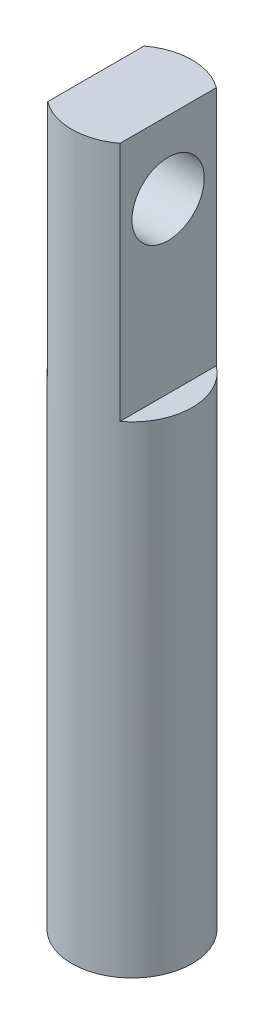
ISO-10303-21;
HEADER;
FILE_DESCRIPTION(('STEP AP214'),'2;1');
FILE_NAME('part.step','',(''),(''),'','','');
FILE_SCHEMA(('AUTOMOTIVE_DESIGN { 1 0 10303 214 1 1 1 1 }'));
ENDSEC;
DATA;
#1=APPLICATION_CONTEXT('core data for automotive mechanical design processes');
#2=APPLICATION_PROTOCOL_DEFINITION('international standard','automotive_design',2000,#1);
#3=PRODUCT_CONTEXT('',#1,'mechanical');
#4=PRODUCT('Part','Part','',(#3));
#5=PRODUCT_RELATED_PRODUCT_CATEGORY('part','',(#4));
#6=PRODUCT_DEFINITION_FORMATION('','',#4);
#7=PRODUCT_DEFINITION_CONTEXT('part definition',#1,'design');
#8=PRODUCT_DEFINITION('design','',#6,#7);
#9=PRODUCT_DEFINITION_SHAPE('','',#8);
#10=(LENGTH_UNIT() NAMED_UNIT(*) SI_UNIT(.MILLI.,.METRE.));
#11=(NAMED_UNIT(*) PLANE_ANGLE_UNIT() SI_UNIT($,.RADIAN.));
#12=(NAMED_UNIT(*) SI_UNIT($,.STERADIAN.) SOLID_ANGLE_UNIT());
#13=UNCERTAINTY_MEASURE_WITH_UNIT(LENGTH_MEASURE(1.E-05),#10,'distance_accuracy_value','');
#14=(GEOMETRIC_REPRESENTATION_CONTEXT(3) GLOBAL_UNCERTAINTY_ASSIGNED_CONTEXT((#13)) GLOBAL_UNIT_ASSIGNED_CONTEXT((#10,
#11,#12)) REPRESENTATION_CONTEXT('',''));
#15=CARTESIAN_POINT('',(0.,0.,0.));
#16=DIRECTION('',(0.,0.,1.));
#17=DIRECTION('',(1.,0.,0.));
#18=AXIS2_PLACEMENT_3D('',#15,#16,#17);
#19=CARTESIAN_POINT('',(0.,30.48,0.));
#20=DIRECTION('',(0.,-1.,0.));
#21=DIRECTION('',(0.,0.,-1.));
#22=AXIS2_PLACEMENT_3D('',#19,#20,#21);
#23=CYLINDRICAL_SURFACE('',#22,2.54);
#24=CARTESIAN_POINT('',(0.,30.48,0.));
#25=DIRECTION('',(0.,1.,0.));
#26=DIRECTION('',(0.,0.,1.));
#27=AXIS2_PLACEMENT_3D('',#24,#25,#26);
#28=CIRCLE('',#27,2.54);
#29=CARTESIAN_POINT('',(-1.524,30.48,2.032));
#30=VERTEX_POINT('',#29);
#31=CARTESIAN_POINT('',(1.524,30.48,2.032));
#32=VERTEX_POINT('',#31);
#33=EDGE_CURVE('E88',#30,#32,#28,.T.);
#34=ORIENTED_EDGE('',*,*,#33,.F.);
#35=DIRECTION('',(0.,-1.,0.));
#36=VECTOR('',#35,1.);
#37=CARTESIAN_POINT('',(-1.524,30.48,2.032));
#38=LINE('',#37,#36);
#39=CARTESIAN_POINT('',(-1.524,20.32,2.032));
#40=VERTEX_POINT('',#39);
#41=EDGE_CURVE('E46',#30,#40,#38,.T.);
#42=ORIENTED_EDGE('',*,*,#41,.T.);
#43=CARTESIAN_POINT('',(0.,20.32,0.));
#44=DIRECTION('',(0.,1.,0.));
#45=DIRECTION('',(0.,0.,1.));
#46=AXIS2_PLACEMENT_3D('',#43,#44,#45);
#47=CIRCLE('',#46,2.54);
#48=CARTESIAN_POINT('',(-1.524,20.32,-2.032));
#49=VERTEX_POINT('',#48);
#50=EDGE_CURVE('E11',#49,#40,#47,.T.);
#51=ORIENTED_EDGE('',*,*,#50,.F.);
#52=DIRECTION('',(0.,-1.,0.));
#53=VECTOR('',#52,1.);
#54=CARTESIAN_POINT('',(-1.524,30.48,-2.032));
#55=LINE('',#54,#53);
#56=CARTESIAN_POINT('',(-1.524,30.48,-2.032));
#57=VERTEX_POINT('',#56);
#58=EDGE_CURVE('E73',#49,#57,#55,.F.);
#59=ORIENTED_EDGE('',*,*,#58,.T.);
#60=CARTESIAN_POINT('',(1.524,30.48,-2.032));
#61=VERTEX_POINT('',#60);
#62=EDGE_CURVE('E83',#61,#57,#28,.T.);
#63=ORIENTED_EDGE('',*,*,#62,.F.);
#64=DIRECTION('',(0.,-1.,0.));
#65=VECTOR('',#64,1.);
#66=CARTESIAN_POINT('',(1.524,30.48,-2.032));
#67=LINE('',#66,#65);
#68=CARTESIAN_POINT('',(1.524,20.32,-2.032));
#69=VERTEX_POINT('',#68);
#70=EDGE_CURVE('E54',#61,#69,#67,.T.);
#71=ORIENTED_EDGE('',*,*,#70,.T.);
#72=CARTESIAN_POINT('',(0.,20.32,0.));
#73=DIRECTION('',(0.,1.,0.));
#74=DIRECTION('',(0.,0.,1.));
#75=AXIS2_PLACEMENT_3D('',#72,#73,#74);
#76=CIRCLE('',#75,2.54);
#77=CARTESIAN_POINT('',(1.524,20.32,2.032));
#78=VERTEX_POINT('',#77);
#79=EDGE_CURVE('E78',#78,#69,#76,.T.);
#80=ORIENTED_EDGE('',*,*,#79,.F.);
#81=DIRECTION('',(0.,-1.,0.));
#82=VECTOR('',#81,1.);
#83=CARTESIAN_POINT('',(1.524,30.48,2.032));
#84=LINE('',#83,#82);
#85=EDGE_CURVE('E102',#78,#32,#84,.F.);
#86=ORIENTED_EDGE('',*,*,#85,.T.);
#87=EDGE_LOOP('',(#34,#42,#51,#59,#63,#71,#80,#86));
#88=FACE_BOUND('',#87,.T.);
#89=CARTESIAN_POINT('',(0.,0.,0.));
#90=DIRECTION('',(0.,1.,0.));
#91=DIRECTION('',(0.,0.,1.));
#92=AXIS2_PLACEMENT_3D('',#89,#90,#91);
#93=CIRCLE('',#92,2.54);
#94=CARTESIAN_POINT('',(0.,0.,2.54));
#95=VERTEX_POINT('',#94);
#96=EDGE_CURVE('E91',#95,#95,#93,.T.);
#97=ORIENTED_EDGE('',*,*,#96,.T.);
#98=EDGE_LOOP('',(#97));
#99=FACE_BOUND('',#98,.T.);
#100=ADVANCED_FACE('F32',(#88,#99),#23,.T.);
#101=CARTESIAN_POINT('',(0.,30.48,0.));
#102=DIRECTION('',(0.,1.,0.));
#103=DIRECTION('',(0.,0.,1.));
#104=AXIS2_PLACEMENT_3D('',#101,#102,#103);
#105=PLANE('',#104);
#106=DIRECTION('',(0.,0.,-1.));
#107=VECTOR('',#106,1.);
#108=CARTESIAN_POINT('',(-1.524,30.48,0.));
#109=LINE('',#108,#107);
#110=EDGE_CURVE('E39',#30,#57,#109,.T.);
#111=ORIENTED_EDGE('',*,*,#110,.F.);
#112=ORIENTED_EDGE('',*,*,#33,.T.);
#113=DIRECTION('',(0.,0.,1.));
#114=VECTOR('',#113,1.);
#115=CARTESIAN_POINT('',(1.524,30.48,0.));
#116=LINE('',#115,#114);
#117=EDGE_CURVE('E87',#61,#32,#116,.T.);
#118=ORIENTED_EDGE('',*,*,#117,.F.);
#119=ORIENTED_EDGE('',*,*,#62,.T.);
#120=EDGE_LOOP('',(#111,#112,#118,#119));
#121=FACE_BOUND('',#120,.T.);
#122=ADVANCED_FACE('F86',(#121),#105,.T.);
#123=CARTESIAN_POINT('',(0.,0.,0.));
#124=DIRECTION('',(0.,1.,0.));
#125=DIRECTION('',(0.,0.,1.));
#126=AXIS2_PLACEMENT_3D('',#123,#124,#125);
#127=PLANE('',#126);
#128=ORIENTED_EDGE('',*,*,#96,.F.);
#129=EDGE_LOOP('',(#128));
#130=FACE_BOUND('',#129,.T.);
#131=ADVANCED_FACE('F134',(#130),#127,.F.);
#132=CARTESIAN_POINT('',(1.524,20.32,-4.79813612759195));
#133=DIRECTION('',(0.,1.,0.));
#134=DIRECTION('',(0.,0.,1.));
#135=AXIS2_PLACEMENT_3D('',#132,#133,#134);
#136=PLANE('',#135);
#137=ORIENTED_EDGE('',*,*,#79,.T.);
#138=DIRECTION('',(0.,0.,1.));
#139=VECTOR('',#138,1.);
#140=CARTESIAN_POINT('',(1.524,20.32,-4.79813612759195));
#141=LINE('',#140,#139);
#142=EDGE_CURVE('E99',#69,#78,#141,.T.);
#143=ORIENTED_EDGE('',*,*,#142,.T.);
#144=EDGE_LOOP('',(#137,#143));
#145=FACE_BOUND('',#144,.T.);
#146=ADVANCED_FACE('F98',(#145),#136,.T.);
#147=CARTESIAN_POINT('',(1.524,20.32,-4.79813612759195));
#148=DIRECTION('',(-1.,0.,0.));
#149=DIRECTION('',(0.,0.,1.));
#150=AXIS2_PLACEMENT_3D('',#147,#148,#149);
#151=PLANE('',#150);
#152=CARTESIAN_POINT('',(1.524,27.432,0.));
#153=DIRECTION('',(-1.,0.,0.));
#154=DIRECTION('',(0.,0.,1.));
#155=AXIS2_PLACEMENT_3D('',#152,#153,#154);
#156=CIRCLE('',#155,1.524);
#157=CARTESIAN_POINT('',(1.524,27.432,1.524));
#158=VERTEX_POINT('',#157);
#159=EDGE_CURVE('E109',#158,#158,#156,.T.);
#160=ORIENTED_EDGE('',*,*,#159,.T.);
#161=EDGE_LOOP('',(#160));
#162=FACE_BOUND('',#161,.T.);
#163=ORIENTED_EDGE('',*,*,#117,.T.);
#164=ORIENTED_EDGE('',*,*,#85,.F.);
#165=ORIENTED_EDGE('',*,*,#142,.F.);
#166=ORIENTED_EDGE('',*,*,#70,.F.);
#167=EDGE_LOOP('',(#163,#164,#165,#166));
#168=FACE_BOUND('',#167,.T.);
#169=ADVANCED_FACE('F101',(#162,#168),#151,.F.);
#170=CARTESIAN_POINT('',(-3.47333343076897,20.32,5.15374143322944));
#171=DIRECTION('',(0.,1.,0.));
#172=DIRECTION('',(0.,0.,1.));
#173=AXIS2_PLACEMENT_3D('',#170,#171,#172);
#174=PLANE('',#173);
#175=ORIENTED_EDGE('',*,*,#50,.T.);
#176=DIRECTION('',(0.,0.,-1.));
#177=VECTOR('',#176,1.);
#178=CARTESIAN_POINT('',(-1.524,20.32,-3.95298015112822));
#179=LINE('',#178,#177);
#180=EDGE_CURVE('E84',#40,#49,#179,.T.);
#181=ORIENTED_EDGE('',*,*,#180,.T.);
#182=EDGE_LOOP('',(#175,#181));
#183=FACE_BOUND('',#182,.T.);
#184=ADVANCED_FACE('F120',(#183),#174,.T.);
#185=CARTESIAN_POINT('',(-1.524,20.32,-3.95298015112822));
#186=DIRECTION('',(1.,0.,0.));
#187=DIRECTION('',(0.,0.,-1.));
#188=AXIS2_PLACEMENT_3D('',#185,#186,#187);
#189=PLANE('',#188);
#190=CARTESIAN_POINT('',(-1.524,27.432,0.));
#191=DIRECTION('',(-1.,0.,0.));
#192=DIRECTION('',(0.,0.,1.));
#193=AXIS2_PLACEMENT_3D('',#190,#191,#192);
#194=CIRCLE('',#193,1.524);
#195=CARTESIAN_POINT('',(-1.524,27.432,1.524));
#196=VERTEX_POINT('',#195);
#197=EDGE_CURVE('E112',#196,#196,#194,.T.);
#198=ORIENTED_EDGE('',*,*,#197,.F.);
#199=EDGE_LOOP('',(#198));
#200=FACE_BOUND('',#199,.T.);
#201=ORIENTED_EDGE('',*,*,#110,.T.);
#202=ORIENTED_EDGE('',*,*,#58,.F.);
#203=ORIENTED_EDGE('',*,*,#180,.F.);
#204=ORIENTED_EDGE('',*,*,#41,.F.);
#205=EDGE_LOOP('',(#201,#202,#203,#204));
#206=FACE_BOUND('',#205,.T.);
#207=ADVANCED_FACE('F72',(#200,#206),#189,.F.);
#208=CARTESIAN_POINT('',(8.476,27.432,0.));
#209=DIRECTION('',(-1.,0.,0.));
#210=DIRECTION('',(0.,0.,1.));
#211=AXIS2_PLACEMENT_3D('',#208,#209,#210);
#212=CYLINDRICAL_SURFACE('',#211,1.524);
#213=ORIENTED_EDGE('',*,*,#197,.T.);
#214=EDGE_LOOP('',(#213));
#215=FACE_BOUND('',#214,.T.);
#216=ORIENTED_EDGE('',*,*,#159,.F.);
#217=EDGE_LOOP('',(#216));
#218=FACE_BOUND('',#217,.T.);
#219=ADVANCED_FACE('F116',(#215,#218),#212,.F.);
#220=CLOSED_SHELL('',(#100,#122,#131,#146,#169,#184,#207,#219));
#221=MANIFOLD_SOLID_BREP('B2',#220);
#222=ADVANCED_BREP_SHAPE_REPRESENTATION('',(#18,#221),#14);
#223=SHAPE_DEFINITION_REPRESENTATION(#9,#222);
ENDSEC;
END-ISO-10303-21;
